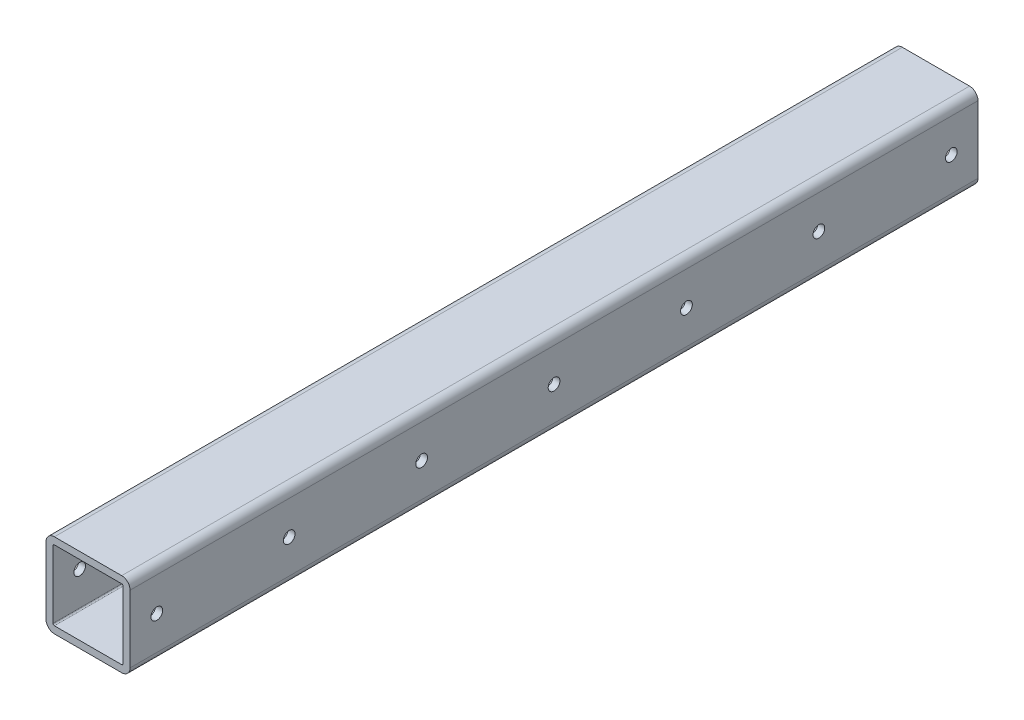
ISO-10303-21;
HEADER;
FILE_DESCRIPTION(('STEP AP214'),'2;1');
FILE_NAME('part.step','',(''),(''),'','','');
FILE_SCHEMA(('AUTOMOTIVE_DESIGN { 1 0 10303 214 1 1 1 1 }'));
ENDSEC;
DATA;
#1=APPLICATION_CONTEXT('core data for automotive mechanical design processes');
#2=APPLICATION_PROTOCOL_DEFINITION('international standard','automotive_design',2000,#1);
#3=PRODUCT_CONTEXT('',#1,'mechanical');
#4=PRODUCT('Part','Part','',(#3));
#5=PRODUCT_RELATED_PRODUCT_CATEGORY('part','',(#4));
#6=PRODUCT_DEFINITION_FORMATION('','',#4);
#7=PRODUCT_DEFINITION_CONTEXT('part definition',#1,'design');
#8=PRODUCT_DEFINITION('design','',#6,#7);
#9=PRODUCT_DEFINITION_SHAPE('','',#8);
#10=(LENGTH_UNIT() NAMED_UNIT(*) SI_UNIT(.MILLI.,.METRE.));
#11=(NAMED_UNIT(*) PLANE_ANGLE_UNIT() SI_UNIT($,.RADIAN.));
#12=(NAMED_UNIT(*) SI_UNIT($,.STERADIAN.) SOLID_ANGLE_UNIT());
#13=UNCERTAINTY_MEASURE_WITH_UNIT(LENGTH_MEASURE(1.E-05),#10,'distance_accuracy_value','');
#14=(GEOMETRIC_REPRESENTATION_CONTEXT(3) GLOBAL_UNCERTAINTY_ASSIGNED_CONTEXT((#13)) GLOBAL_UNIT_ASSIGNED_CONTEXT((#10,
#11,#12)) REPRESENTATION_CONTEXT('',''));
#15=CARTESIAN_POINT('',(0.,0.,0.));
#16=DIRECTION('',(0.,0.,1.));
#17=DIRECTION('',(1.,0.,0.));
#18=AXIS2_PLACEMENT_3D('',#15,#16,#17);
#19=CARTESIAN_POINT('',(0.,0.,192.0875));
#20=DIRECTION('',(0.,0.,1.));
#21=DIRECTION('',(1.,0.,0.));
#22=AXIS2_PLACEMENT_3D('',#19,#20,#21);
#23=PLANE('',#22);
#24=DIRECTION('',(0.,-1.,0.));
#25=VECTOR('',#24,1.);
#26=CARTESIAN_POINT('',(-19.05,19.05,192.0875));
#27=LINE('',#26,#25);
#28=CARTESIAN_POINT('',(-19.05,15.24,192.0875));
#29=VERTEX_POINT('',#28);
#30=CARTESIAN_POINT('',(-19.05,-15.24,192.0875));
#31=VERTEX_POINT('',#30);
#32=EDGE_CURVE('E371',#29,#31,#27,.T.);
#33=ORIENTED_EDGE('',*,*,#32,.T.);
#34=CARTESIAN_POINT('',(-15.24,-15.24,192.0875));
#35=DIRECTION('',(0.,0.,1.));
#36=DIRECTION('',(1.,0.,0.));
#37=AXIS2_PLACEMENT_3D('',#34,#35,#36);
#38=CIRCLE('',#37,3.81);
#39=CARTESIAN_POINT('',(-15.24,-19.05,192.0875));
#40=VERTEX_POINT('',#39);
#41=EDGE_CURVE('E226',#31,#40,#38,.T.);
#42=ORIENTED_EDGE('',*,*,#41,.T.);
#43=DIRECTION('',(1.,0.,0.));
#44=VECTOR('',#43,1.);
#45=CARTESIAN_POINT('',(-19.05,-19.05,192.0875));
#46=LINE('',#45,#44);
#47=CARTESIAN_POINT('',(15.24,-19.05,192.0875));
#48=VERTEX_POINT('',#47);
#49=EDGE_CURVE('E182',#40,#48,#46,.T.);
#50=ORIENTED_EDGE('',*,*,#49,.T.);
#51=CARTESIAN_POINT('',(15.24,-15.24,192.0875));
#52=DIRECTION('',(0.,0.,1.));
#53=DIRECTION('',(1.,0.,0.));
#54=AXIS2_PLACEMENT_3D('',#51,#52,#53);
#55=CIRCLE('',#54,3.81);
#56=CARTESIAN_POINT('',(19.05,-15.24,192.0875));
#57=VERTEX_POINT('',#56);
#58=EDGE_CURVE('E220',#48,#57,#55,.T.);
#59=ORIENTED_EDGE('',*,*,#58,.T.);
#60=DIRECTION('',(0.,1.,0.));
#61=VECTOR('',#60,1.);
#62=CARTESIAN_POINT('',(19.05,19.05,192.0875));
#63=LINE('',#62,#61);
#64=CARTESIAN_POINT('',(19.05,15.24,192.0875));
#65=VERTEX_POINT('',#64);
#66=EDGE_CURVE('E192',#57,#65,#63,.T.);
#67=ORIENTED_EDGE('',*,*,#66,.T.);
#68=CARTESIAN_POINT('',(15.24,15.24,192.0875));
#69=DIRECTION('',(0.,0.,1.));
#70=DIRECTION('',(1.,0.,0.));
#71=AXIS2_PLACEMENT_3D('',#68,#69,#70);
#72=CIRCLE('',#71,3.81);
#73=CARTESIAN_POINT('',(15.24,19.05,192.0875));
#74=VERTEX_POINT('',#73);
#75=EDGE_CURVE('E217',#65,#74,#72,.T.);
#76=ORIENTED_EDGE('',*,*,#75,.T.);
#77=DIRECTION('',(-1.,0.,0.));
#78=VECTOR('',#77,1.);
#79=CARTESIAN_POINT('',(-19.05,19.05,192.0875));
#80=LINE('',#79,#78);
#81=CARTESIAN_POINT('',(-15.24,19.05,192.0875));
#82=VERTEX_POINT('',#81);
#83=EDGE_CURVE('E198',#74,#82,#80,.T.);
#84=ORIENTED_EDGE('',*,*,#83,.T.);
#85=CARTESIAN_POINT('',(-15.24,15.24,192.0875));
#86=DIRECTION('',(0.,0.,1.));
#87=DIRECTION('',(1.,0.,0.));
#88=AXIS2_PLACEMENT_3D('',#85,#86,#87);
#89=CIRCLE('',#88,3.81);
#90=EDGE_CURVE('E223',#82,#29,#89,.T.);
#91=ORIENTED_EDGE('',*,*,#90,.T.);
#92=EDGE_LOOP('',(#33,#42,#50,#59,#67,#76,#84,#91));
#93=FACE_BOUND('',#92,.T.);
#94=DIRECTION('',(-1.,0.,0.));
#95=VECTOR('',#94,1.);
#96=CARTESIAN_POINT('',(-15.875,15.875,192.0875));
#97=LINE('',#96,#95);
#98=CARTESIAN_POINT('',(15.24,15.875,192.0875));
#99=VERTEX_POINT('',#98);
#100=CARTESIAN_POINT('',(-15.24,15.875,192.0875));
#101=VERTEX_POINT('',#100);
#102=EDGE_CURVE('E341',#99,#101,#97,.T.);
#103=ORIENTED_EDGE('',*,*,#102,.F.);
#104=CARTESIAN_POINT('',(15.24,15.24,192.0875));
#105=DIRECTION('',(0.,0.,1.));
#106=DIRECTION('',(1.,0.,0.));
#107=AXIS2_PLACEMENT_3D('',#104,#105,#106);
#108=CIRCLE('',#107,0.635);
#109=CARTESIAN_POINT('',(15.875,15.24,192.0875));
#110=VERTEX_POINT('',#109);
#111=EDGE_CURVE('E273',#99,#110,#108,.F.);
#112=ORIENTED_EDGE('',*,*,#111,.T.);
#113=DIRECTION('',(0.,1.,0.));
#114=VECTOR('',#113,1.);
#115=CARTESIAN_POINT('',(15.875,15.875,192.0875));
#116=LINE('',#115,#114);
#117=CARTESIAN_POINT('',(15.875,-15.24,192.0875));
#118=VERTEX_POINT('',#117);
#119=EDGE_CURVE('E337',#118,#110,#116,.T.);
#120=ORIENTED_EDGE('',*,*,#119,.F.);
#121=CARTESIAN_POINT('',(15.24,-15.24,192.0875));
#122=DIRECTION('',(0.,0.,1.));
#123=DIRECTION('',(1.,0.,0.));
#124=AXIS2_PLACEMENT_3D('',#121,#122,#123);
#125=CIRCLE('',#124,0.635);
#126=CARTESIAN_POINT('',(15.24,-15.875,192.0875));
#127=VERTEX_POINT('',#126);
#128=EDGE_CURVE('E11',#118,#127,#125,.F.);
#129=ORIENTED_EDGE('',*,*,#128,.T.);
#130=DIRECTION('',(1.,0.,0.));
#131=VECTOR('',#130,1.);
#132=CARTESIAN_POINT('',(-15.875,-15.875,192.0875));
#133=LINE('',#132,#131);
#134=CARTESIAN_POINT('',(-15.24,-15.875,192.0875));
#135=VERTEX_POINT('',#134);
#136=EDGE_CURVE('E350',#135,#127,#133,.T.);
#137=ORIENTED_EDGE('',*,*,#136,.F.);
#138=CARTESIAN_POINT('',(-15.24,-15.24,192.0875));
#139=DIRECTION('',(0.,0.,1.));
#140=DIRECTION('',(1.,0.,0.));
#141=AXIS2_PLACEMENT_3D('',#138,#139,#140);
#142=CIRCLE('',#141,0.635);
#143=CARTESIAN_POINT('',(-15.875,-15.24,192.0875));
#144=VERTEX_POINT('',#143);
#145=EDGE_CURVE('E285',#135,#144,#142,.F.);
#146=ORIENTED_EDGE('',*,*,#145,.T.);
#147=DIRECTION('',(0.,-1.,0.));
#148=VECTOR('',#147,1.);
#149=CARTESIAN_POINT('',(-15.875,15.875,192.0875));
#150=LINE('',#149,#148);
#151=CARTESIAN_POINT('',(-15.875,15.24,192.0875));
#152=VERTEX_POINT('',#151);
#153=EDGE_CURVE('E346',#152,#144,#150,.T.);
#154=ORIENTED_EDGE('',*,*,#153,.F.);
#155=CARTESIAN_POINT('',(-15.24,15.24,192.0875));
#156=DIRECTION('',(0.,0.,1.));
#157=DIRECTION('',(1.,0.,0.));
#158=AXIS2_PLACEMENT_3D('',#155,#156,#157);
#159=CIRCLE('',#158,0.635);
#160=EDGE_CURVE('E279',#152,#101,#159,.F.);
#161=ORIENTED_EDGE('',*,*,#160,.T.);
#162=EDGE_LOOP('',(#103,#112,#120,#129,#137,#146,#154,#161));
#163=FACE_BOUND('',#162,.T.);
#164=ADVANCED_FACE('F45',(#93,#163),#23,.T.);
#165=CARTESIAN_POINT('',(0.,0.,-192.0875));
#166=DIRECTION('',(0.,0.,1.));
#167=DIRECTION('',(1.,0.,0.));
#168=AXIS2_PLACEMENT_3D('',#165,#166,#167);
#169=PLANE('',#168);
#170=DIRECTION('',(1.,0.,0.));
#171=VECTOR('',#170,1.);
#172=CARTESIAN_POINT('',(-19.05,-19.05,-192.0875));
#173=LINE('',#172,#171);
#174=CARTESIAN_POINT('',(-15.24,-19.05,-192.0875));
#175=VERTEX_POINT('',#174);
#176=CARTESIAN_POINT('',(15.24,-19.05,-192.0875));
#177=VERTEX_POINT('',#176);
#178=EDGE_CURVE('E179',#175,#177,#173,.T.);
#179=ORIENTED_EDGE('',*,*,#178,.F.);
#180=CARTESIAN_POINT('',(-15.24,-15.24,-192.0875));
#181=DIRECTION('',(0.,0.,1.));
#182=DIRECTION('',(1.,0.,0.));
#183=AXIS2_PLACEMENT_3D('',#180,#181,#182);
#184=CIRCLE('',#183,3.81);
#185=CARTESIAN_POINT('',(-19.05,-15.24,-192.0875));
#186=VERTEX_POINT('',#185);
#187=EDGE_CURVE('E161',#175,#186,#184,.F.);
#188=ORIENTED_EDGE('',*,*,#187,.T.);
#189=DIRECTION('',(0.,-1.,0.));
#190=VECTOR('',#189,1.);
#191=CARTESIAN_POINT('',(-19.05,19.05,-192.0875));
#192=LINE('',#191,#190);
#193=CARTESIAN_POINT('',(-19.05,15.24,-192.0875));
#194=VERTEX_POINT('',#193);
#195=EDGE_CURVE('E193',#194,#186,#192,.T.);
#196=ORIENTED_EDGE('',*,*,#195,.F.);
#197=CARTESIAN_POINT('',(-15.24,15.24,-192.0875));
#198=DIRECTION('',(0.,0.,1.));
#199=DIRECTION('',(1.,0.,0.));
#200=AXIS2_PLACEMENT_3D('',#197,#198,#199);
#201=CIRCLE('',#200,3.81);
#202=CARTESIAN_POINT('',(-15.24,19.05,-192.0875));
#203=VERTEX_POINT('',#202);
#204=EDGE_CURVE('E173',#194,#203,#201,.F.);
#205=ORIENTED_EDGE('',*,*,#204,.T.);
#206=DIRECTION('',(-1.,0.,0.));
#207=VECTOR('',#206,1.);
#208=CARTESIAN_POINT('',(-19.05,19.05,-192.0875));
#209=LINE('',#208,#207);
#210=CARTESIAN_POINT('',(15.24,19.05,-192.0875));
#211=VERTEX_POINT('',#210);
#212=EDGE_CURVE('E200',#211,#203,#209,.T.);
#213=ORIENTED_EDGE('',*,*,#212,.F.);
#214=CARTESIAN_POINT('',(15.24,15.24,-192.0875));
#215=DIRECTION('',(0.,0.,1.));
#216=DIRECTION('',(1.,0.,0.));
#217=AXIS2_PLACEMENT_3D('',#214,#215,#216);
#218=CIRCLE('',#217,3.81);
#219=CARTESIAN_POINT('',(19.05,15.24,-192.0875));
#220=VERTEX_POINT('',#219);
#221=EDGE_CURVE('E184',#211,#220,#218,.F.);
#222=ORIENTED_EDGE('',*,*,#221,.T.);
#223=DIRECTION('',(0.,1.,0.));
#224=VECTOR('',#223,1.);
#225=CARTESIAN_POINT('',(19.05,19.05,-192.0875));
#226=LINE('',#225,#224);
#227=CARTESIAN_POINT('',(19.05,-15.24,-192.0875));
#228=VERTEX_POINT('',#227);
#229=EDGE_CURVE('E353',#228,#220,#226,.T.);
#230=ORIENTED_EDGE('',*,*,#229,.F.);
#231=CARTESIAN_POINT('',(15.24,-15.24,-192.0875));
#232=DIRECTION('',(0.,0.,1.));
#233=DIRECTION('',(1.,0.,0.));
#234=AXIS2_PLACEMENT_3D('',#231,#232,#233);
#235=CIRCLE('',#234,3.81);
#236=EDGE_CURVE('E190',#228,#177,#235,.F.);
#237=ORIENTED_EDGE('',*,*,#236,.T.);
#238=EDGE_LOOP('',(#179,#188,#196,#205,#213,#222,#230,#237));
#239=FACE_BOUND('',#238,.T.);
#240=DIRECTION('',(1.,0.,0.));
#241=VECTOR('',#240,1.);
#242=CARTESIAN_POINT('',(-15.875,-15.875,-192.0875));
#243=LINE('',#242,#241);
#244=CARTESIAN_POINT('',(-15.24,-15.875,-192.0875));
#245=VERTEX_POINT('',#244);
#246=CARTESIAN_POINT('',(15.24,-15.875,-192.0875));
#247=VERTEX_POINT('',#246);
#248=EDGE_CURVE('E342',#245,#247,#243,.T.);
#249=ORIENTED_EDGE('',*,*,#248,.T.);
#250=CARTESIAN_POINT('',(15.24,-15.24,-192.0875));
#251=DIRECTION('',(0.,0.,1.));
#252=DIRECTION('',(1.,0.,0.));
#253=AXIS2_PLACEMENT_3D('',#250,#251,#252);
#254=CIRCLE('',#253,0.635);
#255=CARTESIAN_POINT('',(15.875,-15.24,-192.0875));
#256=VERTEX_POINT('',#255);
#257=EDGE_CURVE('E55',#247,#256,#254,.T.);
#258=ORIENTED_EDGE('',*,*,#257,.T.);
#259=DIRECTION('',(0.,1.,0.));
#260=VECTOR('',#259,1.);
#261=CARTESIAN_POINT('',(15.875,15.875,-192.0875));
#262=LINE('',#261,#260);
#263=CARTESIAN_POINT('',(15.875,15.24,-192.0875));
#264=VERTEX_POINT('',#263);
#265=EDGE_CURVE('E336',#256,#264,#262,.T.);
#266=ORIENTED_EDGE('',*,*,#265,.T.);
#267=CARTESIAN_POINT('',(15.24,15.24,-192.0875));
#268=DIRECTION('',(0.,0.,1.));
#269=DIRECTION('',(1.,0.,0.));
#270=AXIS2_PLACEMENT_3D('',#267,#268,#269);
#271=CIRCLE('',#270,0.635);
#272=CARTESIAN_POINT('',(15.24,15.875,-192.0875));
#273=VERTEX_POINT('',#272);
#274=EDGE_CURVE('E270',#264,#273,#271,.T.);
#275=ORIENTED_EDGE('',*,*,#274,.T.);
#276=DIRECTION('',(-1.,0.,0.));
#277=VECTOR('',#276,1.);
#278=CARTESIAN_POINT('',(-15.875,15.875,-192.0875));
#279=LINE('',#278,#277);
#280=CARTESIAN_POINT('',(-15.24,15.875,-192.0875));
#281=VERTEX_POINT('',#280);
#282=EDGE_CURVE('E357',#273,#281,#279,.T.);
#283=ORIENTED_EDGE('',*,*,#282,.T.);
#284=CARTESIAN_POINT('',(-15.24,15.24,-192.0875));
#285=DIRECTION('',(0.,0.,1.));
#286=DIRECTION('',(1.,0.,0.));
#287=AXIS2_PLACEMENT_3D('',#284,#285,#286);
#288=CIRCLE('',#287,0.635);
#289=CARTESIAN_POINT('',(-15.875,15.24,-192.0875));
#290=VERTEX_POINT('',#289);
#291=EDGE_CURVE('E276',#281,#290,#288,.T.);
#292=ORIENTED_EDGE('',*,*,#291,.T.);
#293=DIRECTION('',(0.,-1.,0.));
#294=VECTOR('',#293,1.);
#295=CARTESIAN_POINT('',(-15.875,15.875,-192.0875));
#296=LINE('',#295,#294);
#297=CARTESIAN_POINT('',(-15.875,-15.24,-192.0875));
#298=VERTEX_POINT('',#297);
#299=EDGE_CURVE('E361',#290,#298,#296,.T.);
#300=ORIENTED_EDGE('',*,*,#299,.T.);
#301=CARTESIAN_POINT('',(-15.24,-15.24,-192.0875));
#302=DIRECTION('',(0.,0.,1.));
#303=DIRECTION('',(1.,0.,0.));
#304=AXIS2_PLACEMENT_3D('',#301,#302,#303);
#305=CIRCLE('',#304,0.635);
#306=EDGE_CURVE('E282',#298,#245,#305,.T.);
#307=ORIENTED_EDGE('',*,*,#306,.T.);
#308=EDGE_LOOP('',(#249,#258,#266,#275,#283,#292,#300,#307));
#309=FACE_BOUND('',#308,.T.);
#310=ADVANCED_FACE('F187',(#239,#309),#169,.F.);
#311=CARTESIAN_POINT('',(19.05,19.05,192.0875));
#312=DIRECTION('',(-1.,0.,0.));
#313=DIRECTION('',(0.,-1.,0.));
#314=AXIS2_PLACEMENT_3D('',#311,#312,#313);
#315=PLANE('',#314);
#316=CARTESIAN_POINT('',(19.05,0.,180.));
#317=DIRECTION('',(1.,0.,0.));
#318=DIRECTION('',(0.,0.,-1.));
#319=AXIS2_PLACEMENT_3D('',#316,#317,#318);
#320=CIRCLE('',#319,2.65000000000001);
#321=CARTESIAN_POINT('',(19.05,0.,177.35));
#322=VERTEX_POINT('',#321);
#323=EDGE_CURVE('E480',#322,#322,#320,.T.);
#324=ORIENTED_EDGE('',*,*,#323,.F.);
#325=EDGE_LOOP('',(#324));
#326=FACE_BOUND('',#325,.T.);
#327=CARTESIAN_POINT('',(19.05,0.,120.));
#328=DIRECTION('',(1.,0.,0.));
#329=DIRECTION('',(0.,0.,-1.));
#330=AXIS2_PLACEMENT_3D('',#327,#328,#329);
#331=CIRCLE('',#330,2.65000000000001);
#332=CARTESIAN_POINT('',(19.05,0.,117.35));
#333=VERTEX_POINT('',#332);
#334=EDGE_CURVE('E483',#333,#333,#331,.T.);
#335=ORIENTED_EDGE('',*,*,#334,.F.);
#336=EDGE_LOOP('',(#335));
#337=FACE_BOUND('',#336,.T.);
#338=CARTESIAN_POINT('',(19.05,0.,60.));
#339=DIRECTION('',(1.,0.,0.));
#340=DIRECTION('',(0.,0.,-1.));
#341=AXIS2_PLACEMENT_3D('',#338,#339,#340);
#342=CIRCLE('',#341,2.65);
#343=CARTESIAN_POINT('',(19.05,0.,57.35));
#344=VERTEX_POINT('',#343);
#345=EDGE_CURVE('E494',#344,#344,#342,.T.);
#346=ORIENTED_EDGE('',*,*,#345,.F.);
#347=EDGE_LOOP('',(#346));
#348=FACE_BOUND('',#347,.T.);
#349=CARTESIAN_POINT('',(19.05,0.,0.));
#350=DIRECTION('',(1.,0.,0.));
#351=DIRECTION('',(0.,0.,-1.));
#352=AXIS2_PLACEMENT_3D('',#349,#350,#351);
#353=CIRCLE('',#352,2.65);
#354=CARTESIAN_POINT('',(19.05,0.,-2.65));
#355=VERTEX_POINT('',#354);
#356=EDGE_CURVE('E500',#355,#355,#353,.T.);
#357=ORIENTED_EDGE('',*,*,#356,.F.);
#358=EDGE_LOOP('',(#357));
#359=FACE_BOUND('',#358,.T.);
#360=CARTESIAN_POINT('',(19.05,0.,-60.));
#361=DIRECTION('',(1.,0.,0.));
#362=DIRECTION('',(0.,0.,-1.));
#363=AXIS2_PLACEMENT_3D('',#360,#361,#362);
#364=CIRCLE('',#363,2.65);
#365=CARTESIAN_POINT('',(19.05,0.,-62.65));
#366=VERTEX_POINT('',#365);
#367=EDGE_CURVE('E508',#366,#366,#364,.T.);
#368=ORIENTED_EDGE('',*,*,#367,.F.);
#369=EDGE_LOOP('',(#368));
#370=FACE_BOUND('',#369,.T.);
#371=CARTESIAN_POINT('',(19.05,0.,-120.));
#372=DIRECTION('',(1.,0.,0.));
#373=DIRECTION('',(0.,0.,-1.));
#374=AXIS2_PLACEMENT_3D('',#371,#372,#373);
#375=CIRCLE('',#374,2.65000000000001);
#376=CARTESIAN_POINT('',(19.05,0.,-122.65));
#377=VERTEX_POINT('',#376);
#378=EDGE_CURVE('E516',#377,#377,#375,.T.);
#379=ORIENTED_EDGE('',*,*,#378,.F.);
#380=EDGE_LOOP('',(#379));
#381=FACE_BOUND('',#380,.T.);
#382=CARTESIAN_POINT('',(19.05,0.,-180.));
#383=DIRECTION('',(1.,0.,0.));
#384=DIRECTION('',(0.,0.,-1.));
#385=AXIS2_PLACEMENT_3D('',#382,#383,#384);
#386=CIRCLE('',#385,2.65000000000001);
#387=CARTESIAN_POINT('',(19.05,0.,-182.65));
#388=VERTEX_POINT('',#387);
#389=EDGE_CURVE('E524',#388,#388,#386,.T.);
#390=ORIENTED_EDGE('',*,*,#389,.F.);
#391=EDGE_LOOP('',(#390));
#392=FACE_BOUND('',#391,.T.);
#393=ORIENTED_EDGE('',*,*,#66,.F.);
#394=DIRECTION('',(0.,0.,-1.));
#395=VECTOR('',#394,1.);
#396=CARTESIAN_POINT('',(19.05,-15.24,192.0875));
#397=LINE('',#396,#395);
#398=EDGE_CURVE('E239',#57,#228,#397,.T.);
#399=ORIENTED_EDGE('',*,*,#398,.T.);
#400=ORIENTED_EDGE('',*,*,#229,.T.);
#401=DIRECTION('',(0.,0.,-1.));
#402=VECTOR('',#401,1.);
#403=CARTESIAN_POINT('',(19.05,15.24,192.0875));
#404=LINE('',#403,#402);
#405=EDGE_CURVE('E236',#220,#65,#404,.F.);
#406=ORIENTED_EDGE('',*,*,#405,.T.);
#407=EDGE_LOOP('',(#393,#399,#400,#406));
#408=FACE_BOUND('',#407,.T.);
#409=ADVANCED_FACE('F406',(#326,#337,#348,#359,#370,#381,#392,#408),#315,.F.);
#410=CARTESIAN_POINT('',(-19.05,19.05,192.0875));
#411=DIRECTION('',(0.,-1.,0.));
#412=DIRECTION('',(0.,0.,-1.));
#413=AXIS2_PLACEMENT_3D('',#410,#411,#412);
#414=PLANE('',#413);
#415=ORIENTED_EDGE('',*,*,#212,.T.);
#416=DIRECTION('',(0.,0.,-1.));
#417=VECTOR('',#416,1.);
#418=CARTESIAN_POINT('',(-15.24,19.05,192.0875));
#419=LINE('',#418,#417);
#420=EDGE_CURVE('E233',#203,#82,#419,.F.);
#421=ORIENTED_EDGE('',*,*,#420,.T.);
#422=ORIENTED_EDGE('',*,*,#83,.F.);
#423=DIRECTION('',(0.,0.,-1.));
#424=VECTOR('',#423,1.);
#425=CARTESIAN_POINT('',(15.24,19.05,192.0875));
#426=LINE('',#425,#424);
#427=EDGE_CURVE('E229',#74,#211,#426,.T.);
#428=ORIENTED_EDGE('',*,*,#427,.T.);
#429=EDGE_LOOP('',(#415,#421,#422,#428));
#430=FACE_BOUND('',#429,.T.);
#431=ADVANCED_FACE('F384',(#430),#414,.F.);
#432=CARTESIAN_POINT('',(-19.05,19.05,192.0875));
#433=DIRECTION('',(1.,0.,0.));
#434=DIRECTION('',(0.,1.,0.));
#435=AXIS2_PLACEMENT_3D('',#432,#433,#434);
#436=PLANE('',#435);
#437=CARTESIAN_POINT('',(-19.05,0.,180.));
#438=DIRECTION('',(1.,0.,0.));
#439=DIRECTION('',(0.,0.,-1.));
#440=AXIS2_PLACEMENT_3D('',#437,#438,#439);
#441=CIRCLE('',#440,2.65000000000001);
#442=CARTESIAN_POINT('',(-19.05,0.,177.35));
#443=VERTEX_POINT('',#442);
#444=EDGE_CURVE('E295',#443,#443,#441,.T.);
#445=ORIENTED_EDGE('',*,*,#444,.T.);
#446=EDGE_LOOP('',(#445));
#447=FACE_BOUND('',#446,.T.);
#448=CARTESIAN_POINT('',(-19.05,0.,120.));
#449=DIRECTION('',(1.,0.,0.));
#450=DIRECTION('',(0.,0.,-1.));
#451=AXIS2_PLACEMENT_3D('',#448,#449,#450);
#452=CIRCLE('',#451,2.65000000000001);
#453=CARTESIAN_POINT('',(-19.05,0.,117.35));
#454=VERTEX_POINT('',#453);
#455=EDGE_CURVE('E489',#454,#454,#452,.T.);
#456=ORIENTED_EDGE('',*,*,#455,.T.);
#457=EDGE_LOOP('',(#456));
#458=FACE_BOUND('',#457,.T.);
#459=CARTESIAN_POINT('',(-19.05,0.,60.));
#460=DIRECTION('',(1.,0.,0.));
#461=DIRECTION('',(0.,0.,-1.));
#462=AXIS2_PLACEMENT_3D('',#459,#460,#461);
#463=CIRCLE('',#462,2.65);
#464=CARTESIAN_POINT('',(-19.05,0.,57.35));
#465=VERTEX_POINT('',#464);
#466=EDGE_CURVE('E496',#465,#465,#463,.T.);
#467=ORIENTED_EDGE('',*,*,#466,.T.);
#468=EDGE_LOOP('',(#467));
#469=FACE_BOUND('',#468,.T.);
#470=CARTESIAN_POINT('',(-19.05,0.,0.));
#471=DIRECTION('',(1.,0.,0.));
#472=DIRECTION('',(0.,0.,-1.));
#473=AXIS2_PLACEMENT_3D('',#470,#471,#472);
#474=CIRCLE('',#473,2.65);
#475=CARTESIAN_POINT('',(-19.05,0.,-2.65));
#476=VERTEX_POINT('',#475);
#477=EDGE_CURVE('E504',#476,#476,#474,.T.);
#478=ORIENTED_EDGE('',*,*,#477,.T.);
#479=EDGE_LOOP('',(#478));
#480=FACE_BOUND('',#479,.T.);
#481=CARTESIAN_POINT('',(-19.05,0.,-60.));
#482=DIRECTION('',(1.,0.,0.));
#483=DIRECTION('',(0.,0.,-1.));
#484=AXIS2_PLACEMENT_3D('',#481,#482,#483);
#485=CIRCLE('',#484,2.65);
#486=CARTESIAN_POINT('',(-19.05,0.,-62.65));
#487=VERTEX_POINT('',#486);
#488=EDGE_CURVE('E512',#487,#487,#485,.T.);
#489=ORIENTED_EDGE('',*,*,#488,.T.);
#490=EDGE_LOOP('',(#489));
#491=FACE_BOUND('',#490,.T.);
#492=CARTESIAN_POINT('',(-19.05,0.,-120.));
#493=DIRECTION('',(1.,0.,0.));
#494=DIRECTION('',(0.,0.,-1.));
#495=AXIS2_PLACEMENT_3D('',#492,#493,#494);
#496=CIRCLE('',#495,2.65000000000001);
#497=CARTESIAN_POINT('',(-19.05,0.,-122.65));
#498=VERTEX_POINT('',#497);
#499=EDGE_CURVE('E520',#498,#498,#496,.T.);
#500=ORIENTED_EDGE('',*,*,#499,.T.);
#501=EDGE_LOOP('',(#500));
#502=FACE_BOUND('',#501,.T.);
#503=CARTESIAN_POINT('',(-19.05,0.,-180.));
#504=DIRECTION('',(1.,0.,0.));
#505=DIRECTION('',(0.,0.,-1.));
#506=AXIS2_PLACEMENT_3D('',#503,#504,#505);
#507=CIRCLE('',#506,2.65000000000001);
#508=CARTESIAN_POINT('',(-19.05,0.,-182.65));
#509=VERTEX_POINT('',#508);
#510=EDGE_CURVE('E528',#509,#509,#507,.T.);
#511=ORIENTED_EDGE('',*,*,#510,.T.);
#512=EDGE_LOOP('',(#511));
#513=FACE_BOUND('',#512,.T.);
#514=ORIENTED_EDGE('',*,*,#195,.T.);
#515=DIRECTION('',(0.,0.,-1.));
#516=VECTOR('',#515,1.);
#517=CARTESIAN_POINT('',(-19.05,-15.24,192.0875));
#518=LINE('',#517,#516);
#519=EDGE_CURVE('E166',#186,#31,#518,.F.);
#520=ORIENTED_EDGE('',*,*,#519,.T.);
#521=ORIENTED_EDGE('',*,*,#32,.F.);
#522=DIRECTION('',(0.,0.,-1.));
#523=VECTOR('',#522,1.);
#524=CARTESIAN_POINT('',(-19.05,15.24,192.0875));
#525=LINE('',#524,#523);
#526=EDGE_CURVE('E172',#29,#194,#525,.T.);
#527=ORIENTED_EDGE('',*,*,#526,.T.);
#528=EDGE_LOOP('',(#514,#520,#521,#527));
#529=FACE_BOUND('',#528,.T.);
#530=ADVANCED_FACE('F394',(#447,#458,#469,#480,#491,#502,#513,#529),#436,.F.);
#531=CARTESIAN_POINT('',(-19.05,-19.05,192.0875));
#532=DIRECTION('',(0.,1.,0.));
#533=DIRECTION('',(0.,0.,1.));
#534=AXIS2_PLACEMENT_3D('',#531,#532,#533);
#535=PLANE('',#534);
#536=ORIENTED_EDGE('',*,*,#49,.F.);
#537=DIRECTION('',(0.,0.,-1.));
#538=VECTOR('',#537,1.);
#539=CARTESIAN_POINT('',(-15.24,-19.05,192.0875));
#540=LINE('',#539,#538);
#541=EDGE_CURVE('E165',#40,#175,#540,.T.);
#542=ORIENTED_EDGE('',*,*,#541,.T.);
#543=ORIENTED_EDGE('',*,*,#178,.T.);
#544=DIRECTION('',(0.,0.,-1.));
#545=VECTOR('',#544,1.);
#546=CARTESIAN_POINT('',(15.24,-19.05,192.0875));
#547=LINE('',#546,#545);
#548=EDGE_CURVE('E185',#177,#48,#547,.F.);
#549=ORIENTED_EDGE('',*,*,#548,.T.);
#550=EDGE_LOOP('',(#536,#542,#543,#549));
#551=FACE_BOUND('',#550,.T.);
#552=ADVANCED_FACE('F178',(#551),#535,.F.);
#553=CARTESIAN_POINT('',(15.875,15.875,192.0875));
#554=DIRECTION('',(-1.,0.,0.));
#555=DIRECTION('',(0.,-1.,0.));
#556=AXIS2_PLACEMENT_3D('',#553,#554,#555);
#557=PLANE('',#556);
#558=CARTESIAN_POINT('',(15.875,0.,180.));
#559=DIRECTION('',(-1.,0.,0.));
#560=DIRECTION('',(0.,-1.,0.));
#561=AXIS2_PLACEMENT_3D('',#558,#559,#560);
#562=CIRCLE('',#561,2.65000000000001);
#563=CARTESIAN_POINT('',(15.875,-2.65000000000001,180.));
#564=VERTEX_POINT('',#563);
#565=EDGE_CURVE('E332',#564,#564,#562,.T.);
#566=ORIENTED_EDGE('',*,*,#565,.F.);
#567=EDGE_LOOP('',(#566));
#568=FACE_BOUND('',#567,.T.);
#569=CARTESIAN_POINT('',(15.875,0.,120.));
#570=DIRECTION('',(-1.,0.,0.));
#571=DIRECTION('',(0.,-1.,0.));
#572=AXIS2_PLACEMENT_3D('',#569,#570,#571);
#573=CIRCLE('',#572,2.65000000000001);
#574=CARTESIAN_POINT('',(15.875,-2.65000000000001,120.));
#575=VERTEX_POINT('',#574);
#576=EDGE_CURVE('E318',#575,#575,#573,.T.);
#577=ORIENTED_EDGE('',*,*,#576,.F.);
#578=EDGE_LOOP('',(#577));
#579=FACE_BOUND('',#578,.T.);
#580=CARTESIAN_POINT('',(15.875,0.,60.));
#581=DIRECTION('',(-1.,0.,0.));
#582=DIRECTION('',(0.,-1.,0.));
#583=AXIS2_PLACEMENT_3D('',#580,#581,#582);
#584=CIRCLE('',#583,2.65);
#585=CARTESIAN_POINT('',(15.875,-2.65,60.));
#586=VERTEX_POINT('',#585);
#587=EDGE_CURVE('E314',#586,#586,#584,.T.);
#588=ORIENTED_EDGE('',*,*,#587,.F.);
#589=EDGE_LOOP('',(#588));
#590=FACE_BOUND('',#589,.T.);
#591=CARTESIAN_POINT('',(15.875,0.,0.));
#592=DIRECTION('',(-1.,0.,0.));
#593=DIRECTION('',(0.,-1.,0.));
#594=AXIS2_PLACEMENT_3D('',#591,#592,#593);
#595=CIRCLE('',#594,2.65);
#596=CARTESIAN_POINT('',(15.875,-2.65,0.));
#597=VERTEX_POINT('',#596);
#598=EDGE_CURVE('E310',#597,#597,#595,.T.);
#599=ORIENTED_EDGE('',*,*,#598,.F.);
#600=EDGE_LOOP('',(#599));
#601=FACE_BOUND('',#600,.T.);
#602=CARTESIAN_POINT('',(15.875,0.,-60.));
#603=DIRECTION('',(-1.,0.,0.));
#604=DIRECTION('',(0.,-1.,0.));
#605=AXIS2_PLACEMENT_3D('',#602,#603,#604);
#606=CIRCLE('',#605,2.65);
#607=CARTESIAN_POINT('',(15.875,-2.65,-60.));
#608=VERTEX_POINT('',#607);
#609=EDGE_CURVE('E305',#608,#608,#606,.T.);
#610=ORIENTED_EDGE('',*,*,#609,.F.);
#611=EDGE_LOOP('',(#610));
#612=FACE_BOUND('',#611,.T.);
#613=CARTESIAN_POINT('',(15.875,0.,-120.));
#614=DIRECTION('',(-1.,0.,0.));
#615=DIRECTION('',(0.,-1.,0.));
#616=AXIS2_PLACEMENT_3D('',#613,#614,#615);
#617=CIRCLE('',#616,2.65000000000001);
#618=CARTESIAN_POINT('',(15.875,-2.65000000000001,-120.));
#619=VERTEX_POINT('',#618);
#620=EDGE_CURVE('E300',#619,#619,#617,.T.);
#621=ORIENTED_EDGE('',*,*,#620,.F.);
#622=EDGE_LOOP('',(#621));
#623=FACE_BOUND('',#622,.T.);
#624=CARTESIAN_POINT('',(15.875,0.,-180.));
#625=DIRECTION('',(-1.,0.,0.));
#626=DIRECTION('',(0.,-1.,0.));
#627=AXIS2_PLACEMENT_3D('',#624,#625,#626);
#628=CIRCLE('',#627,2.65000000000001);
#629=CARTESIAN_POINT('',(15.875,-2.65000000000001,-180.));
#630=VERTEX_POINT('',#629);
#631=EDGE_CURVE('E294',#630,#630,#628,.T.);
#632=ORIENTED_EDGE('',*,*,#631,.F.);
#633=EDGE_LOOP('',(#632));
#634=FACE_BOUND('',#633,.T.);
#635=ORIENTED_EDGE('',*,*,#119,.T.);
#636=DIRECTION('',(0.,0.,-1.));
#637=VECTOR('',#636,1.);
#638=CARTESIAN_POINT('',(15.875,15.24,-192.0875));
#639=LINE('',#638,#637);
#640=EDGE_CURVE('E246',#110,#264,#639,.T.);
#641=ORIENTED_EDGE('',*,*,#640,.T.);
#642=ORIENTED_EDGE('',*,*,#265,.F.);
#643=DIRECTION('',(0.,0.,-1.));
#644=VECTOR('',#643,1.);
#645=CARTESIAN_POINT('',(15.875,-15.24,192.0875));
#646=LINE('',#645,#644);
#647=EDGE_CURVE('E243',#256,#118,#646,.F.);
#648=ORIENTED_EDGE('',*,*,#647,.T.);
#649=EDGE_LOOP('',(#635,#641,#642,#648));
#650=FACE_BOUND('',#649,.T.);
#651=ADVANCED_FACE('F403',(#568,#579,#590,#601,#612,#623,#634,#650),#557,.T.);
#652=CARTESIAN_POINT('',(-15.875,15.875,192.0875));
#653=DIRECTION('',(0.,-1.,0.));
#654=DIRECTION('',(0.,0.,-1.));
#655=AXIS2_PLACEMENT_3D('',#652,#653,#654);
#656=PLANE('',#655);
#657=ORIENTED_EDGE('',*,*,#282,.F.);
#658=DIRECTION('',(0.,0.,-1.));
#659=VECTOR('',#658,1.);
#660=CARTESIAN_POINT('',(15.24,15.875,192.0875));
#661=LINE('',#660,#659);
#662=EDGE_CURVE('E254',#273,#99,#661,.F.);
#663=ORIENTED_EDGE('',*,*,#662,.T.);
#664=ORIENTED_EDGE('',*,*,#102,.T.);
#665=DIRECTION('',(0.,0.,-1.));
#666=VECTOR('',#665,1.);
#667=CARTESIAN_POINT('',(-15.24,15.875,-192.0875));
#668=LINE('',#667,#666);
#669=EDGE_CURVE('E250',#101,#281,#668,.T.);
#670=ORIENTED_EDGE('',*,*,#669,.T.);
#671=EDGE_LOOP('',(#657,#663,#664,#670));
#672=FACE_BOUND('',#671,.T.);
#673=ADVANCED_FACE('F419',(#672),#656,.T.);
#674=CARTESIAN_POINT('',(-15.875,15.875,192.0875));
#675=DIRECTION('',(1.,0.,0.));
#676=DIRECTION('',(0.,1.,0.));
#677=AXIS2_PLACEMENT_3D('',#674,#675,#676);
#678=PLANE('',#677);
#679=CARTESIAN_POINT('',(-15.875,0.,180.));
#680=DIRECTION('',(1.,0.,0.));
#681=DIRECTION('',(0.,1.,0.));
#682=AXIS2_PLACEMENT_3D('',#679,#680,#681);
#683=CIRCLE('',#682,2.65000000000001);
#684=CARTESIAN_POINT('',(-15.875,2.65000000000001,180.));
#685=VERTEX_POINT('',#684);
#686=EDGE_CURVE('E49',#685,#685,#683,.T.);
#687=ORIENTED_EDGE('',*,*,#686,.F.);
#688=EDGE_LOOP('',(#687));
#689=FACE_BOUND('',#688,.T.);
#690=CARTESIAN_POINT('',(-15.875,0.,120.));
#691=DIRECTION('',(1.,0.,0.));
#692=DIRECTION('',(0.,1.,0.));
#693=AXIS2_PLACEMENT_3D('',#690,#691,#692);
#694=CIRCLE('',#693,2.65000000000001);
#695=CARTESIAN_POINT('',(-15.875,2.65000000000001,120.));
#696=VERTEX_POINT('',#695);
#697=EDGE_CURVE('E315',#696,#696,#694,.T.);
#698=ORIENTED_EDGE('',*,*,#697,.F.);
#699=EDGE_LOOP('',(#698));
#700=FACE_BOUND('',#699,.T.);
#701=CARTESIAN_POINT('',(-15.875,0.,60.));
#702=DIRECTION('',(1.,0.,0.));
#703=DIRECTION('',(0.,1.,0.));
#704=AXIS2_PLACEMENT_3D('',#701,#702,#703);
#705=CIRCLE('',#704,2.65);
#706=CARTESIAN_POINT('',(-15.875,2.65,60.));
#707=VERTEX_POINT('',#706);
#708=EDGE_CURVE('E311',#707,#707,#705,.T.);
#709=ORIENTED_EDGE('',*,*,#708,.F.);
#710=EDGE_LOOP('',(#709));
#711=FACE_BOUND('',#710,.T.);
#712=CARTESIAN_POINT('',(-15.875,0.,0.));
#713=DIRECTION('',(1.,0.,0.));
#714=DIRECTION('',(0.,1.,0.));
#715=AXIS2_PLACEMENT_3D('',#712,#713,#714);
#716=CIRCLE('',#715,2.65);
#717=CARTESIAN_POINT('',(-15.875,2.65,0.));
#718=VERTEX_POINT('',#717);
#719=EDGE_CURVE('E306',#718,#718,#716,.T.);
#720=ORIENTED_EDGE('',*,*,#719,.F.);
#721=EDGE_LOOP('',(#720));
#722=FACE_BOUND('',#721,.T.);
#723=CARTESIAN_POINT('',(-15.875,0.,-60.));
#724=DIRECTION('',(1.,0.,0.));
#725=DIRECTION('',(0.,1.,0.));
#726=AXIS2_PLACEMENT_3D('',#723,#724,#725);
#727=CIRCLE('',#726,2.65);
#728=CARTESIAN_POINT('',(-15.875,2.65,-60.));
#729=VERTEX_POINT('',#728);
#730=EDGE_CURVE('E301',#729,#729,#727,.T.);
#731=ORIENTED_EDGE('',*,*,#730,.F.);
#732=EDGE_LOOP('',(#731));
#733=FACE_BOUND('',#732,.T.);
#734=CARTESIAN_POINT('',(-15.875,0.,-120.));
#735=DIRECTION('',(1.,0.,0.));
#736=DIRECTION('',(0.,1.,0.));
#737=AXIS2_PLACEMENT_3D('',#734,#735,#736);
#738=CIRCLE('',#737,2.65000000000001);
#739=CARTESIAN_POINT('',(-15.875,2.65000000000001,-120.));
#740=VERTEX_POINT('',#739);
#741=EDGE_CURVE('E296',#740,#740,#738,.T.);
#742=ORIENTED_EDGE('',*,*,#741,.F.);
#743=EDGE_LOOP('',(#742));
#744=FACE_BOUND('',#743,.T.);
#745=CARTESIAN_POINT('',(-15.875,0.,-180.));
#746=DIRECTION('',(1.,0.,0.));
#747=DIRECTION('',(0.,1.,0.));
#748=AXIS2_PLACEMENT_3D('',#745,#746,#747);
#749=CIRCLE('',#748,2.65000000000001);
#750=CARTESIAN_POINT('',(-15.875,2.65000000000001,-180.));
#751=VERTEX_POINT('',#750);
#752=EDGE_CURVE('E290',#751,#751,#749,.T.);
#753=ORIENTED_EDGE('',*,*,#752,.F.);
#754=EDGE_LOOP('',(#753));
#755=FACE_BOUND('',#754,.T.);
#756=ORIENTED_EDGE('',*,*,#299,.F.);
#757=DIRECTION('',(0.,0.,-1.));
#758=VECTOR('',#757,1.);
#759=CARTESIAN_POINT('',(-15.875,15.24,192.0875));
#760=LINE('',#759,#758);
#761=EDGE_CURVE('E261',#290,#152,#760,.F.);
#762=ORIENTED_EDGE('',*,*,#761,.T.);
#763=ORIENTED_EDGE('',*,*,#153,.T.);
#764=DIRECTION('',(0.,0.,-1.));
#765=VECTOR('',#764,1.);
#766=CARTESIAN_POINT('',(-15.875,-15.24,-192.0875));
#767=LINE('',#766,#765);
#768=EDGE_CURVE('E257',#144,#298,#767,.T.);
#769=ORIENTED_EDGE('',*,*,#768,.T.);
#770=EDGE_LOOP('',(#756,#762,#763,#769));
#771=FACE_BOUND('',#770,.T.);
#772=ADVANCED_FACE('F423',(#689,#700,#711,#722,#733,#744,#755,#771),#678,.T.);
#773=CARTESIAN_POINT('',(-15.875,-15.875,192.0875));
#774=DIRECTION('',(0.,1.,0.));
#775=DIRECTION('',(0.,0.,1.));
#776=AXIS2_PLACEMENT_3D('',#773,#774,#775);
#777=PLANE('',#776);
#778=ORIENTED_EDGE('',*,*,#248,.F.);
#779=DIRECTION('',(0.,0.,-1.));
#780=VECTOR('',#779,1.);
#781=CARTESIAN_POINT('',(-15.24,-15.875,192.0875));
#782=LINE('',#781,#780);
#783=EDGE_CURVE('E68',#245,#135,#782,.F.);
#784=ORIENTED_EDGE('',*,*,#783,.T.);
#785=ORIENTED_EDGE('',*,*,#136,.T.);
#786=DIRECTION('',(0.,0.,-1.));
#787=VECTOR('',#786,1.);
#788=CARTESIAN_POINT('',(15.24,-15.875,-192.0875));
#789=LINE('',#788,#787);
#790=EDGE_CURVE('E264',#127,#247,#789,.T.);
#791=ORIENTED_EDGE('',*,*,#790,.T.);
#792=EDGE_LOOP('',(#778,#784,#785,#791));
#793=FACE_BOUND('',#792,.T.);
#794=ADVANCED_FACE('F427',(#793),#777,.T.);
#795=CARTESIAN_POINT('',(-15.24,-15.24,192.0875));
#796=DIRECTION('',(0.,0.,-1.));
#797=DIRECTION('',(-1.,0.,0.));
#798=AXIS2_PLACEMENT_3D('',#795,#796,#797);
#799=CYLINDRICAL_SURFACE('',#798,3.81);
#800=ORIENTED_EDGE('',*,*,#41,.F.);
#801=ORIENTED_EDGE('',*,*,#519,.F.);
#802=ORIENTED_EDGE('',*,*,#187,.F.);
#803=ORIENTED_EDGE('',*,*,#541,.F.);
#804=EDGE_LOOP('',(#800,#801,#802,#803));
#805=FACE_BOUND('',#804,.T.);
#806=ADVANCED_FACE('F164',(#805),#799,.T.);
#807=CARTESIAN_POINT('',(-15.24,15.24,192.0875));
#808=DIRECTION('',(0.,0.,-1.));
#809=DIRECTION('',(-1.,0.,0.));
#810=AXIS2_PLACEMENT_3D('',#807,#808,#809);
#811=CYLINDRICAL_SURFACE('',#810,3.81);
#812=ORIENTED_EDGE('',*,*,#90,.F.);
#813=ORIENTED_EDGE('',*,*,#420,.F.);
#814=ORIENTED_EDGE('',*,*,#204,.F.);
#815=ORIENTED_EDGE('',*,*,#526,.F.);
#816=EDGE_LOOP('',(#812,#813,#814,#815));
#817=FACE_BOUND('',#816,.T.);
#818=ADVANCED_FACE('F389',(#817),#811,.T.);
#819=CARTESIAN_POINT('',(15.24,-15.24,192.0875));
#820=DIRECTION('',(0.,0.,-1.));
#821=DIRECTION('',(-1.,0.,0.));
#822=AXIS2_PLACEMENT_3D('',#819,#820,#821);
#823=CYLINDRICAL_SURFACE('',#822,3.81);
#824=ORIENTED_EDGE('',*,*,#58,.F.);
#825=ORIENTED_EDGE('',*,*,#548,.F.);
#826=ORIENTED_EDGE('',*,*,#236,.F.);
#827=ORIENTED_EDGE('',*,*,#398,.F.);
#828=EDGE_LOOP('',(#824,#825,#826,#827));
#829=FACE_BOUND('',#828,.T.);
#830=ADVANCED_FACE('F587',(#829),#823,.T.);
#831=CARTESIAN_POINT('',(15.24,15.24,192.0875));
#832=DIRECTION('',(0.,0.,-1.));
#833=DIRECTION('',(-1.,0.,0.));
#834=AXIS2_PLACEMENT_3D('',#831,#832,#833);
#835=CYLINDRICAL_SURFACE('',#834,3.81);
#836=ORIENTED_EDGE('',*,*,#75,.F.);
#837=ORIENTED_EDGE('',*,*,#405,.F.);
#838=ORIENTED_EDGE('',*,*,#221,.F.);
#839=ORIENTED_EDGE('',*,*,#427,.F.);
#840=EDGE_LOOP('',(#836,#837,#838,#839));
#841=FACE_BOUND('',#840,.T.);
#842=ADVANCED_FACE('F585',(#841),#835,.T.);
#843=CARTESIAN_POINT('',(15.24,15.24,192.0875));
#844=DIRECTION('',(0.,0.,1.));
#845=DIRECTION('',(1.,0.,0.));
#846=AXIS2_PLACEMENT_3D('',#843,#844,#845);
#847=CYLINDRICAL_SURFACE('',#846,0.635);
#848=ORIENTED_EDGE('',*,*,#111,.F.);
#849=ORIENTED_EDGE('',*,*,#662,.F.);
#850=ORIENTED_EDGE('',*,*,#274,.F.);
#851=ORIENTED_EDGE('',*,*,#640,.F.);
#852=EDGE_LOOP('',(#848,#849,#850,#851));
#853=FACE_BOUND('',#852,.T.);
#854=ADVANCED_FACE('F556',(#853),#847,.F.);
#855=CARTESIAN_POINT('',(-15.24,15.24,192.0875));
#856=DIRECTION('',(0.,0.,1.));
#857=DIRECTION('',(1.,0.,0.));
#858=AXIS2_PLACEMENT_3D('',#855,#856,#857);
#859=CYLINDRICAL_SURFACE('',#858,0.635);
#860=ORIENTED_EDGE('',*,*,#160,.F.);
#861=ORIENTED_EDGE('',*,*,#761,.F.);
#862=ORIENTED_EDGE('',*,*,#291,.F.);
#863=ORIENTED_EDGE('',*,*,#669,.F.);
#864=EDGE_LOOP('',(#860,#861,#862,#863));
#865=FACE_BOUND('',#864,.T.);
#866=ADVANCED_FACE('F563',(#865),#859,.F.);
#867=CARTESIAN_POINT('',(-15.24,-15.24,192.0875));
#868=DIRECTION('',(0.,0.,1.));
#869=DIRECTION('',(1.,0.,0.));
#870=AXIS2_PLACEMENT_3D('',#867,#868,#869);
#871=CYLINDRICAL_SURFACE('',#870,0.635);
#872=ORIENTED_EDGE('',*,*,#145,.F.);
#873=ORIENTED_EDGE('',*,*,#783,.F.);
#874=ORIENTED_EDGE('',*,*,#306,.F.);
#875=ORIENTED_EDGE('',*,*,#768,.F.);
#876=EDGE_LOOP('',(#872,#873,#874,#875));
#877=FACE_BOUND('',#876,.T.);
#878=ADVANCED_FACE('F571',(#877),#871,.F.);
#879=CARTESIAN_POINT('',(15.24,-15.24,192.0875));
#880=DIRECTION('',(0.,0.,1.));
#881=DIRECTION('',(1.,0.,0.));
#882=AXIS2_PLACEMENT_3D('',#879,#880,#881);
#883=CYLINDRICAL_SURFACE('',#882,0.635);
#884=ORIENTED_EDGE('',*,*,#128,.F.);
#885=ORIENTED_EDGE('',*,*,#647,.F.);
#886=ORIENTED_EDGE('',*,*,#257,.F.);
#887=ORIENTED_EDGE('',*,*,#790,.F.);
#888=EDGE_LOOP('',(#884,#885,#886,#887));
#889=FACE_BOUND('',#888,.T.);
#890=ADVANCED_FACE('F47',(#889),#883,.F.);
#891=CARTESIAN_POINT('',(-19.05,0.,-180.));
#892=DIRECTION('',(1.,0.,0.));
#893=DIRECTION('',(0.,0.,-1.));
#894=AXIS2_PLACEMENT_3D('',#891,#892,#893);
#895=CYLINDRICAL_SURFACE('',#894,2.65000000000001);
#896=ORIENTED_EDGE('',*,*,#752,.T.);
#897=EDGE_LOOP('',(#896));
#898=FACE_BOUND('',#897,.T.);
#899=ORIENTED_EDGE('',*,*,#510,.F.);
#900=EDGE_LOOP('',(#899));
#901=FACE_BOUND('',#900,.T.);
#902=ADVANCED_FACE('F431',(#898,#901),#895,.F.);
#903=CARTESIAN_POINT('',(-19.05,0.,-120.));
#904=DIRECTION('',(1.,0.,0.));
#905=DIRECTION('',(0.,0.,-1.));
#906=AXIS2_PLACEMENT_3D('',#903,#904,#905);
#907=CYLINDRICAL_SURFACE('',#906,2.65000000000001);
#908=ORIENTED_EDGE('',*,*,#741,.T.);
#909=EDGE_LOOP('',(#908));
#910=FACE_BOUND('',#909,.T.);
#911=ORIENTED_EDGE('',*,*,#499,.F.);
#912=EDGE_LOOP('',(#911));
#913=FACE_BOUND('',#912,.T.);
#914=ADVANCED_FACE('F434',(#910,#913),#907,.F.);
#915=CARTESIAN_POINT('',(-19.05,0.,-60.));
#916=DIRECTION('',(1.,0.,0.));
#917=DIRECTION('',(0.,0.,-1.));
#918=AXIS2_PLACEMENT_3D('',#915,#916,#917);
#919=CYLINDRICAL_SURFACE('',#918,2.65);
#920=ORIENTED_EDGE('',*,*,#730,.T.);
#921=EDGE_LOOP('',(#920));
#922=FACE_BOUND('',#921,.T.);
#923=ORIENTED_EDGE('',*,*,#488,.F.);
#924=EDGE_LOOP('',(#923));
#925=FACE_BOUND('',#924,.T.);
#926=ADVANCED_FACE('F439',(#922,#925),#919,.F.);
#927=CARTESIAN_POINT('',(-19.05,0.,0.));
#928=DIRECTION('',(1.,0.,0.));
#929=DIRECTION('',(0.,0.,-1.));
#930=AXIS2_PLACEMENT_3D('',#927,#928,#929);
#931=CYLINDRICAL_SURFACE('',#930,2.65);
#932=ORIENTED_EDGE('',*,*,#719,.T.);
#933=EDGE_LOOP('',(#932));
#934=FACE_BOUND('',#933,.T.);
#935=ORIENTED_EDGE('',*,*,#477,.F.);
#936=EDGE_LOOP('',(#935));
#937=FACE_BOUND('',#936,.T.);
#938=ADVANCED_FACE('F444',(#934,#937),#931,.F.);
#939=CARTESIAN_POINT('',(-19.05,0.,60.));
#940=DIRECTION('',(1.,0.,0.));
#941=DIRECTION('',(0.,0.,-1.));
#942=AXIS2_PLACEMENT_3D('',#939,#940,#941);
#943=CYLINDRICAL_SURFACE('',#942,2.65);
#944=ORIENTED_EDGE('',*,*,#708,.T.);
#945=EDGE_LOOP('',(#944));
#946=FACE_BOUND('',#945,.T.);
#947=ORIENTED_EDGE('',*,*,#466,.F.);
#948=EDGE_LOOP('',(#947));
#949=FACE_BOUND('',#948,.T.);
#950=ADVANCED_FACE('F449',(#946,#949),#943,.F.);
#951=CARTESIAN_POINT('',(-19.05,0.,120.));
#952=DIRECTION('',(1.,0.,0.));
#953=DIRECTION('',(0.,0.,-1.));
#954=AXIS2_PLACEMENT_3D('',#951,#952,#953);
#955=CYLINDRICAL_SURFACE('',#954,2.65000000000001);
#956=ORIENTED_EDGE('',*,*,#697,.T.);
#957=EDGE_LOOP('',(#956));
#958=FACE_BOUND('',#957,.T.);
#959=ORIENTED_EDGE('',*,*,#455,.F.);
#960=EDGE_LOOP('',(#959));
#961=FACE_BOUND('',#960,.T.);
#962=ADVANCED_FACE('F454',(#958,#961),#955,.F.);
#963=CARTESIAN_POINT('',(-19.05,0.,180.));
#964=DIRECTION('',(1.,0.,0.));
#965=DIRECTION('',(0.,0.,-1.));
#966=AXIS2_PLACEMENT_3D('',#963,#964,#965);
#967=CYLINDRICAL_SURFACE('',#966,2.65000000000001);
#968=ORIENTED_EDGE('',*,*,#686,.T.);
#969=EDGE_LOOP('',(#968));
#970=FACE_BOUND('',#969,.T.);
#971=ORIENTED_EDGE('',*,*,#444,.F.);
#972=EDGE_LOOP('',(#971));
#973=FACE_BOUND('',#972,.T.);
#974=ADVANCED_FACE('F459',(#970,#973),#967,.F.);
#975=ORIENTED_EDGE('',*,*,#631,.T.);
#976=EDGE_LOOP('',(#975));
#977=FACE_BOUND('',#976,.T.);
#978=ORIENTED_EDGE('',*,*,#389,.T.);
#979=EDGE_LOOP('',(#978));
#980=FACE_BOUND('',#979,.T.);
#981=ADVANCED_FACE('F436',(#977,#980),#895,.F.);
#982=ORIENTED_EDGE('',*,*,#620,.T.);
#983=EDGE_LOOP('',(#982));
#984=FACE_BOUND('',#983,.T.);
#985=ORIENTED_EDGE('',*,*,#378,.T.);
#986=EDGE_LOOP('',(#985));
#987=FACE_BOUND('',#986,.T.);
#988=ADVANCED_FACE('F441',(#984,#987),#907,.F.);
#989=ORIENTED_EDGE('',*,*,#609,.T.);
#990=EDGE_LOOP('',(#989));
#991=FACE_BOUND('',#990,.T.);
#992=ORIENTED_EDGE('',*,*,#367,.T.);
#993=EDGE_LOOP('',(#992));
#994=FACE_BOUND('',#993,.T.);
#995=ADVANCED_FACE('F446',(#991,#994),#919,.F.);
#996=ORIENTED_EDGE('',*,*,#598,.T.);
#997=EDGE_LOOP('',(#996));
#998=FACE_BOUND('',#997,.T.);
#999=ORIENTED_EDGE('',*,*,#356,.T.);
#1000=EDGE_LOOP('',(#999));
#1001=FACE_BOUND('',#1000,.T.);
#1002=ADVANCED_FACE('F451',(#998,#1001),#931,.F.);
#1003=ORIENTED_EDGE('',*,*,#587,.T.);
#1004=EDGE_LOOP('',(#1003));
#1005=FACE_BOUND('',#1004,.T.);
#1006=ORIENTED_EDGE('',*,*,#345,.T.);
#1007=EDGE_LOOP('',(#1006));
#1008=FACE_BOUND('',#1007,.T.);
#1009=ADVANCED_FACE('F456',(#1005,#1008),#943,.F.);
#1010=ORIENTED_EDGE('',*,*,#576,.T.);
#1011=EDGE_LOOP('',(#1010));
#1012=FACE_BOUND('',#1011,.T.);
#1013=ORIENTED_EDGE('',*,*,#334,.T.);
#1014=EDGE_LOOP('',(#1013));
#1015=FACE_BOUND('',#1014,.T.);
#1016=ADVANCED_FACE('F460',(#1012,#1015),#955,.F.);
#1017=ORIENTED_EDGE('',*,*,#565,.T.);
#1018=EDGE_LOOP('',(#1017));
#1019=FACE_BOUND('',#1018,.T.);
#1020=ORIENTED_EDGE('',*,*,#323,.T.);
#1021=EDGE_LOOP('',(#1020));
#1022=FACE_BOUND('',#1021,.T.);
#1023=ADVANCED_FACE('F463',(#1019,#1022),#967,.F.);
#1024=CLOSED_SHELL('',(#164,#310,#409,#431,#530,#552,#651,#673,#772,#794,#806,#818,#830,#842,
#854,#866,#878,#890,#902,#914,#926,#938,#950,#962,#974,#981,#988,#995,#1002,#1009,#1016,#1023));
#1025=MANIFOLD_SOLID_BREP('B2',#1024);
#1026=ADVANCED_BREP_SHAPE_REPRESENTATION('',(#18,#1025),#14);
#1027=SHAPE_DEFINITION_REPRESENTATION(#9,#1026);
ENDSEC;
END-ISO-10303-21;
